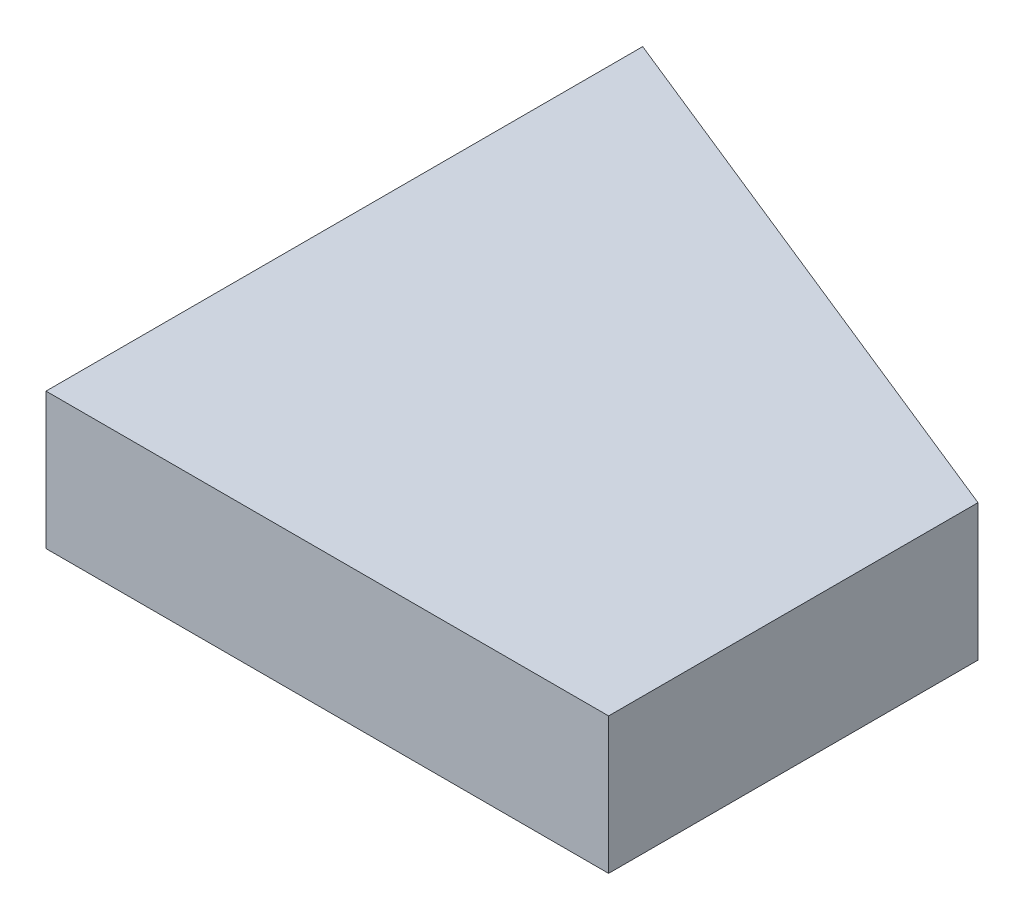
ISO-10303-21;
HEADER;
FILE_DESCRIPTION(('STEP AP214'),'2;1');
FILE_NAME('part.step','',(''),(''),'','','');
FILE_SCHEMA(('AUTOMOTIVE_DESIGN { 1 0 10303 214 1 1 1 1 }'));
ENDSEC;
DATA;
#1=APPLICATION_CONTEXT('core data for automotive mechanical design processes');
#2=APPLICATION_PROTOCOL_DEFINITION('international standard','automotive_design',2000,#1);
#3=PRODUCT_CONTEXT('',#1,'mechanical');
#4=PRODUCT('Part','Part','',(#3));
#5=PRODUCT_RELATED_PRODUCT_CATEGORY('part','',(#4));
#6=PRODUCT_DEFINITION_FORMATION('','',#4);
#7=PRODUCT_DEFINITION_CONTEXT('part definition',#1,'design');
#8=PRODUCT_DEFINITION('design','',#6,#7);
#9=PRODUCT_DEFINITION_SHAPE('','',#8);
#10=(LENGTH_UNIT() NAMED_UNIT(*) SI_UNIT(.MILLI.,.METRE.));
#11=(NAMED_UNIT(*) PLANE_ANGLE_UNIT() SI_UNIT($,.RADIAN.));
#12=(NAMED_UNIT(*) SI_UNIT($,.STERADIAN.) SOLID_ANGLE_UNIT());
#13=UNCERTAINTY_MEASURE_WITH_UNIT(LENGTH_MEASURE(1.E-05),#10,'distance_accuracy_value','');
#14=(GEOMETRIC_REPRESENTATION_CONTEXT(3) GLOBAL_UNCERTAINTY_ASSIGNED_CONTEXT((#13)) GLOBAL_UNIT_ASSIGNED_CONTEXT((#10,
#11,#12)) REPRESENTATION_CONTEXT('',''));
#15=CARTESIAN_POINT('',(0.,0.,0.));
#16=DIRECTION('',(0.,0.,1.));
#17=DIRECTION('',(1.,0.,0.));
#18=AXIS2_PLACEMENT_3D('',#15,#16,#17);
#19=CARTESIAN_POINT('',(0.,8.,0.));
#20=DIRECTION('',(1.,0.,0.));
#21=DIRECTION('',(0.,0.,-1.));
#22=AXIS2_PLACEMENT_3D('',#19,#20,#21);
#23=PLANE('',#22);
#24=CARTESIAN_POINT('',(0.,4.,-17.5));
#25=DIRECTION('',(1.,0.,0.));
#26=DIRECTION('',(0.,0.,-1.));
#27=AXIS2_PLACEMENT_3D('',#24,#25,#26);
#28=CIRCLE('',#27,1.5);
#29=CARTESIAN_POINT('',(0.,4.,-19.));
#30=VERTEX_POINT('',#29);
#31=EDGE_CURVE('E109',#30,#30,#28,.T.);
#32=ORIENTED_EDGE('',*,*,#31,.T.);
#33=EDGE_LOOP('',(#32));
#34=FACE_BOUND('',#33,.T.);
#35=DIRECTION('',(0.,0.,1.));
#36=VECTOR('',#35,1.);
#37=CARTESIAN_POINT('',(0.,0.,0.));
#38=LINE('',#37,#36);
#39=CARTESIAN_POINT('',(0.,0.,-35.));
#40=VERTEX_POINT('',#39);
#41=CARTESIAN_POINT('',(0.,0.,0.));
#42=VERTEX_POINT('',#41);
#43=EDGE_CURVE('E95',#40,#42,#38,.T.);
#44=ORIENTED_EDGE('',*,*,#43,.T.);
#45=DIRECTION('',(0.,-1.,0.));
#46=VECTOR('',#45,1.);
#47=CARTESIAN_POINT('',(0.,8.,0.));
#48=LINE('',#47,#46);
#49=CARTESIAN_POINT('',(0.,8.,0.));
#50=VERTEX_POINT('',#49);
#51=EDGE_CURVE('E11',#50,#42,#48,.T.);
#52=ORIENTED_EDGE('',*,*,#51,.F.);
#53=DIRECTION('',(0.,0.,1.));
#54=VECTOR('',#53,1.);
#55=CARTESIAN_POINT('',(0.,8.,0.));
#56=LINE('',#55,#54);
#57=CARTESIAN_POINT('',(0.,8.,-35.));
#58=VERTEX_POINT('',#57);
#59=EDGE_CURVE('E83',#58,#50,#56,.T.);
#60=ORIENTED_EDGE('',*,*,#59,.F.);
#61=DIRECTION('',(0.,-1.,0.));
#62=VECTOR('',#61,1.);
#63=CARTESIAN_POINT('',(0.,8.,-35.));
#64=LINE('',#63,#62);
#65=EDGE_CURVE('E91',#58,#40,#64,.T.);
#66=ORIENTED_EDGE('',*,*,#65,.T.);
#67=EDGE_LOOP('',(#44,#52,#60,#66));
#68=FACE_BOUND('',#67,.T.);
#69=ADVANCED_FACE('F32',(#34,#68),#23,.F.);
#70=CARTESIAN_POINT('',(0.,8.,0.));
#71=DIRECTION('',(0.,0.,-1.));
#72=DIRECTION('',(-1.,0.,0.));
#73=AXIS2_PLACEMENT_3D('',#70,#71,#72);
#74=PLANE('',#73);
#75=DIRECTION('',(1.,0.,0.));
#76=VECTOR('',#75,1.);
#77=CARTESIAN_POINT('',(0.,0.,0.));
#78=LINE('',#77,#76);
#79=CARTESIAN_POINT('',(33.,0.,0.));
#80=VERTEX_POINT('',#79);
#81=EDGE_CURVE('E87',#42,#80,#78,.T.);
#82=ORIENTED_EDGE('',*,*,#81,.T.);
#83=DIRECTION('',(0.,-1.,0.));
#84=VECTOR('',#83,1.);
#85=CARTESIAN_POINT('',(33.,8.,0.));
#86=LINE('',#85,#84);
#87=CARTESIAN_POINT('',(33.,8.,0.));
#88=VERTEX_POINT('',#87);
#89=EDGE_CURVE('E40',#88,#80,#86,.T.);
#90=ORIENTED_EDGE('',*,*,#89,.F.);
#91=DIRECTION('',(1.,0.,0.));
#92=VECTOR('',#91,1.);
#93=CARTESIAN_POINT('',(0.,8.,0.));
#94=LINE('',#93,#92);
#95=EDGE_CURVE('E78',#50,#88,#94,.T.);
#96=ORIENTED_EDGE('',*,*,#95,.F.);
#97=ORIENTED_EDGE('',*,*,#51,.T.);
#98=EDGE_LOOP('',(#82,#90,#96,#97));
#99=FACE_BOUND('',#98,.T.);
#100=ADVANCED_FACE('F86',(#99),#74,.F.);
#101=CARTESIAN_POINT('',(33.,8.,0.));
#102=DIRECTION('',(-1.,0.,0.));
#103=DIRECTION('',(0.,0.,1.));
#104=AXIS2_PLACEMENT_3D('',#101,#102,#103);
#105=PLANE('',#104);
#106=DIRECTION('',(0.,0.,-1.));
#107=VECTOR('',#106,1.);
#108=CARTESIAN_POINT('',(33.,0.,0.));
#109=LINE('',#108,#107);
#110=CARTESIAN_POINT('',(33.,0.,-21.6671345474397));
#111=VERTEX_POINT('',#110);
#112=EDGE_CURVE('E65',#80,#111,#109,.T.);
#113=ORIENTED_EDGE('',*,*,#112,.T.);
#114=DIRECTION('',(0.,-1.,0.));
#115=VECTOR('',#114,1.);
#116=CARTESIAN_POINT('',(33.,8.,-21.6671345474397));
#117=LINE('',#116,#115);
#118=CARTESIAN_POINT('',(33.,8.,-21.6671345474397));
#119=VERTEX_POINT('',#118);
#120=EDGE_CURVE('E88',#119,#111,#117,.T.);
#121=ORIENTED_EDGE('',*,*,#120,.F.);
#122=DIRECTION('',(0.,0.,-1.));
#123=VECTOR('',#122,1.);
#124=CARTESIAN_POINT('',(33.,8.,0.));
#125=LINE('',#124,#123);
#126=EDGE_CURVE('E81',#88,#119,#125,.T.);
#127=ORIENTED_EDGE('',*,*,#126,.F.);
#128=ORIENTED_EDGE('',*,*,#89,.T.);
#129=EDGE_LOOP('',(#113,#121,#127,#128));
#130=FACE_BOUND('',#129,.T.);
#131=ADVANCED_FACE('F89',(#130),#105,.F.);
#132=CARTESIAN_POINT('',(0.,8.,-35.));
#133=DIRECTION('',(-0.374606593415916,0.,0.927183854566786));
#134=DIRECTION('',(0.927183854566786,0.,0.374606593415916));
#135=AXIS2_PLACEMENT_3D('',#132,#133,#134);
#136=PLANE('',#135);
#137=DIRECTION('',(-0.927183854566786,0.,-0.374606593415916));
#138=VECTOR('',#137,1.);
#139=CARTESIAN_POINT('',(0.,0.,-35.));
#140=LINE('',#139,#138);
#141=EDGE_CURVE('E71',#111,#40,#140,.T.);
#142=ORIENTED_EDGE('',*,*,#141,.T.);
#143=ORIENTED_EDGE('',*,*,#65,.F.);
#144=DIRECTION('',(-0.927183854566786,0.,-0.374606593415916));
#145=VECTOR('',#144,1.);
#146=CARTESIAN_POINT('',(0.,8.,-35.));
#147=LINE('',#146,#145);
#148=EDGE_CURVE('E48',#119,#58,#147,.T.);
#149=ORIENTED_EDGE('',*,*,#148,.F.);
#150=ORIENTED_EDGE('',*,*,#120,.T.);
#151=EDGE_LOOP('',(#142,#143,#149,#150));
#152=FACE_BOUND('',#151,.T.);
#153=ADVANCED_FACE('F103',(#152),#136,.F.);
#154=CARTESIAN_POINT('',(0.,8.,0.));
#155=DIRECTION('',(0.,-1.,0.));
#156=DIRECTION('',(0.,0.,-1.));
#157=AXIS2_PLACEMENT_3D('',#154,#155,#156);
#158=PLANE('',#157);
#159=ORIENTED_EDGE('',*,*,#59,.T.);
#160=ORIENTED_EDGE('',*,*,#95,.T.);
#161=ORIENTED_EDGE('',*,*,#126,.T.);
#162=ORIENTED_EDGE('',*,*,#148,.T.);
#163=EDGE_LOOP('',(#159,#160,#161,#162));
#164=FACE_BOUND('',#163,.T.);
#165=ADVANCED_FACE('F79',(#164),#158,.F.);
#166=CARTESIAN_POINT('',(0.,0.,0.));
#167=DIRECTION('',(0.,-1.,0.));
#168=DIRECTION('',(0.,0.,-1.));
#169=AXIS2_PLACEMENT_3D('',#166,#167,#168);
#170=PLANE('',#169);
#171=ORIENTED_EDGE('',*,*,#43,.F.);
#172=ORIENTED_EDGE('',*,*,#141,.F.);
#173=ORIENTED_EDGE('',*,*,#112,.F.);
#174=ORIENTED_EDGE('',*,*,#81,.F.);
#175=EDGE_LOOP('',(#171,#172,#173,#174));
#176=FACE_BOUND('',#175,.T.);
#177=ADVANCED_FACE('F106',(#176),#170,.T.);
#178=CARTESIAN_POINT('',(20.,4.,-17.5));
#179=DIRECTION('',(-1.,0.,0.));
#180=DIRECTION('',(0.,0.,1.));
#181=AXIS2_PLACEMENT_3D('',#178,#179,#180);
#182=CYLINDRICAL_SURFACE('',#181,1.5);
#183=CARTESIAN_POINT('',(20.,4.,-17.5));
#184=DIRECTION('',(1.,0.,0.));
#185=DIRECTION('',(0.,0.,-1.));
#186=AXIS2_PLACEMENT_3D('',#183,#184,#185);
#187=CIRCLE('',#186,1.5);
#188=CARTESIAN_POINT('',(20.,4.,-19.));
#189=VERTEX_POINT('',#188);
#190=EDGE_CURVE('E98',#189,#189,#187,.T.);
#191=ORIENTED_EDGE('',*,*,#190,.T.);
#192=EDGE_LOOP('',(#191));
#193=FACE_BOUND('',#192,.T.);
#194=ORIENTED_EDGE('',*,*,#31,.F.);
#195=EDGE_LOOP('',(#194));
#196=FACE_BOUND('',#195,.T.);
#197=ADVANCED_FACE('F115',(#193,#196),#182,.F.);
#198=CARTESIAN_POINT('',(20.,4.,-17.5));
#199=DIRECTION('',(1.,0.,0.));
#200=DIRECTION('',(0.,0.,-1.));
#201=AXIS2_PLACEMENT_3D('',#198,#199,#200);
#202=PLANE('',#201);
#203=ORIENTED_EDGE('',*,*,#190,.F.);
#204=EDGE_LOOP('',(#203));
#205=FACE_BOUND('',#204,.T.);
#206=ADVANCED_FACE('F118',(#205),#202,.F.);
#207=CLOSED_SHELL('',(#69,#100,#131,#153,#165,#177,#197,#206));
#208=MANIFOLD_SOLID_BREP('B2',#207);
#209=ADVANCED_BREP_SHAPE_REPRESENTATION('',(#18,#208),#14);
#210=SHAPE_DEFINITION_REPRESENTATION(#9,#209);
ENDSEC;
END-ISO-10303-21;
